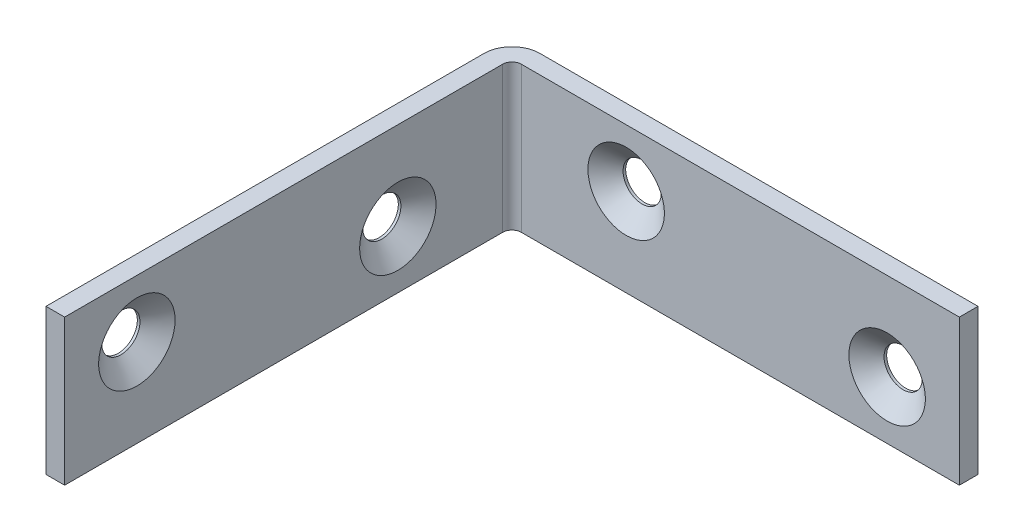
ISO-10303-21;
HEADER;
FILE_DESCRIPTION(('STEP AP214'),'2;1');
FILE_NAME('part.step','',(''),(''),'','','');
FILE_SCHEMA(('AUTOMOTIVE_DESIGN { 1 0 10303 214 1 1 1 1 }'));
ENDSEC;
DATA;
#1=APPLICATION_CONTEXT('core data for automotive mechanical design processes');
#2=APPLICATION_PROTOCOL_DEFINITION('international standard','automotive_design',2000,#1);
#3=PRODUCT_CONTEXT('',#1,'mechanical');
#4=PRODUCT('Part','Part','',(#3));
#5=PRODUCT_RELATED_PRODUCT_CATEGORY('part','',(#4));
#6=PRODUCT_DEFINITION_FORMATION('','',#4);
#7=PRODUCT_DEFINITION_CONTEXT('part definition',#1,'design');
#8=PRODUCT_DEFINITION('design','',#6,#7);
#9=PRODUCT_DEFINITION_SHAPE('','',#8);
#10=(LENGTH_UNIT() NAMED_UNIT(*) SI_UNIT(.MILLI.,.METRE.));
#11=(NAMED_UNIT(*) PLANE_ANGLE_UNIT() SI_UNIT($,.RADIAN.));
#12=(NAMED_UNIT(*) SI_UNIT($,.STERADIAN.) SOLID_ANGLE_UNIT());
#13=UNCERTAINTY_MEASURE_WITH_UNIT(LENGTH_MEASURE(1.E-05),#10,'distance_accuracy_value','');
#14=(GEOMETRIC_REPRESENTATION_CONTEXT(3) GLOBAL_UNCERTAINTY_ASSIGNED_CONTEXT((#13)) GLOBAL_UNIT_ASSIGNED_CONTEXT((#10,
#11,#12)) REPRESENTATION_CONTEXT('',''));
#15=CARTESIAN_POINT('',(0.,0.,0.));
#16=DIRECTION('',(0.,0.,1.));
#17=DIRECTION('',(1.,0.,0.));
#18=AXIS2_PLACEMENT_3D('',#15,#16,#17);
#19=CARTESIAN_POINT('',(3.048,7.9375,2.032));
#20=DIRECTION('',(0.,0.,-1.));
#21=DIRECTION('',(-1.,0.,0.));
#22=AXIS2_PLACEMENT_3D('',#19,#20,#21);
#23=PLANE('',#22);
#24=CARTESIAN_POINT('',(14.478,1.651,2.032));
#25=DIRECTION('',(0.,0.,-1.));
#26=DIRECTION('',(-1.,0.,0.));
#27=AXIS2_PLACEMENT_3D('',#24,#25,#26);
#28=CIRCLE('',#27,4.16560000000001);
#29=CARTESIAN_POINT('',(10.3124,1.651,2.032));
#30=VERTEX_POINT('',#29);
#31=EDGE_CURVE('E105',#30,#30,#28,.T.);
#32=ORIENTED_EDGE('',*,*,#31,.T.);
#33=EDGE_LOOP('',(#32));
#34=FACE_BOUND('',#33,.T.);
#35=CARTESIAN_POINT('',(42.926,-1.651,2.032));
#36=DIRECTION('',(0.,0.,-1.));
#37=DIRECTION('',(-1.,0.,0.));
#38=AXIS2_PLACEMENT_3D('',#35,#36,#37);
#39=CIRCLE('',#38,4.16560000000001);
#40=CARTESIAN_POINT('',(38.7604,-1.651,2.032));
#41=VERTEX_POINT('',#40);
#42=EDGE_CURVE('E233',#41,#41,#39,.T.);
#43=ORIENTED_EDGE('',*,*,#42,.T.);
#44=EDGE_LOOP('',(#43));
#45=FACE_BOUND('',#44,.T.);
#46=DIRECTION('',(1.,0.,0.));
#47=VECTOR('',#46,1.);
#48=CARTESIAN_POINT('',(3.048,-7.9375,2.032));
#49=LINE('',#48,#47);
#50=CARTESIAN_POINT('',(3.048,-7.9375,2.032));
#51=VERTEX_POINT('',#50);
#52=CARTESIAN_POINT('',(50.8,-7.9375,2.032));
#53=VERTEX_POINT('',#52);
#54=EDGE_CURVE('E202',#51,#53,#49,.T.);
#55=ORIENTED_EDGE('',*,*,#54,.T.);
#56=DIRECTION('',(0.,-1.,0.));
#57=VECTOR('',#56,1.);
#58=CARTESIAN_POINT('',(50.8,7.9375,2.032));
#59=LINE('',#58,#57);
#60=CARTESIAN_POINT('',(50.8,7.9375,2.032));
#61=VERTEX_POINT('',#60);
#62=EDGE_CURVE('E230',#61,#53,#59,.T.);
#63=ORIENTED_EDGE('',*,*,#62,.F.);
#64=DIRECTION('',(1.,0.,0.));
#65=VECTOR('',#64,1.);
#66=CARTESIAN_POINT('',(3.048,7.9375,2.032));
#67=LINE('',#66,#65);
#68=CARTESIAN_POINT('',(3.048,7.9375,2.032));
#69=VERTEX_POINT('',#68);
#70=EDGE_CURVE('E160',#69,#61,#67,.T.);
#71=ORIENTED_EDGE('',*,*,#70,.F.);
#72=DIRECTION('',(0.,-1.,0.));
#73=VECTOR('',#72,1.);
#74=CARTESIAN_POINT('',(3.048,7.9375,2.032));
#75=LINE('',#74,#73);
#76=EDGE_CURVE('E201',#69,#51,#75,.T.);
#77=ORIENTED_EDGE('',*,*,#76,.T.);
#78=EDGE_LOOP('',(#55,#63,#71,#77));
#79=FACE_BOUND('',#78,.T.);
#80=ADVANCED_FACE('F101',(#34,#45,#79),#23,.F.);
#81=CARTESIAN_POINT('',(50.8,7.9375,0.));
#82=DIRECTION('',(1.,0.,0.));
#83=DIRECTION('',(0.,0.,-1.));
#84=AXIS2_PLACEMENT_3D('',#81,#82,#83);
#85=PLANE('',#84);
#86=DIRECTION('',(0.,0.,1.));
#87=VECTOR('',#86,1.);
#88=CARTESIAN_POINT('',(50.8,-7.9375,0.));
#89=LINE('',#88,#87);
#90=CARTESIAN_POINT('',(50.8,-7.9375,0.));
#91=VERTEX_POINT('',#90);
#92=EDGE_CURVE('E205',#91,#53,#89,.T.);
#93=ORIENTED_EDGE('',*,*,#92,.F.);
#94=DIRECTION('',(0.,-1.,0.));
#95=VECTOR('',#94,1.);
#96=CARTESIAN_POINT('',(50.8,7.9375,0.));
#97=LINE('',#96,#95);
#98=CARTESIAN_POINT('',(50.8,7.9375,0.));
#99=VERTEX_POINT('',#98);
#100=EDGE_CURVE('E228',#99,#91,#97,.T.);
#101=ORIENTED_EDGE('',*,*,#100,.F.);
#102=DIRECTION('',(0.,0.,1.));
#103=VECTOR('',#102,1.);
#104=CARTESIAN_POINT('',(50.8,7.9375,0.));
#105=LINE('',#104,#103);
#106=EDGE_CURVE('E455',#99,#61,#105,.T.);
#107=ORIENTED_EDGE('',*,*,#106,.T.);
#108=ORIENTED_EDGE('',*,*,#62,.T.);
#109=EDGE_LOOP('',(#93,#101,#107,#108));
#110=FACE_BOUND('',#109,.T.);
#111=ADVANCED_FACE('F280',(#110),#85,.T.);
#112=CARTESIAN_POINT('',(3.048,7.9375,0.));
#113=DIRECTION('',(0.,0.,-1.));
#114=DIRECTION('',(-1.,0.,0.));
#115=AXIS2_PLACEMENT_3D('',#112,#113,#114);
#116=PLANE('',#115);
#117=CARTESIAN_POINT('',(14.478,1.651,0.));
#118=DIRECTION('',(0.,0.,1.));
#119=DIRECTION('',(1.,0.,0.));
#120=AXIS2_PLACEMENT_3D('',#117,#118,#119);
#121=CIRCLE('',#120,2.0828);
#122=CARTESIAN_POINT('',(16.5608,1.651,0.));
#123=VERTEX_POINT('',#122);
#124=EDGE_CURVE('E239',#123,#123,#121,.T.);
#125=ORIENTED_EDGE('',*,*,#124,.T.);
#126=EDGE_LOOP('',(#125));
#127=FACE_BOUND('',#126,.T.);
#128=CARTESIAN_POINT('',(42.926,-1.651,0.));
#129=DIRECTION('',(0.,0.,1.));
#130=DIRECTION('',(1.,0.,0.));
#131=AXIS2_PLACEMENT_3D('',#128,#129,#130);
#132=CIRCLE('',#131,2.0828);
#133=CARTESIAN_POINT('',(45.0088,-1.651,0.));
#134=VERTEX_POINT('',#133);
#135=EDGE_CURVE('E206',#134,#134,#132,.T.);
#136=ORIENTED_EDGE('',*,*,#135,.T.);
#137=EDGE_LOOP('',(#136));
#138=FACE_BOUND('',#137,.T.);
#139=DIRECTION('',(1.,0.,0.));
#140=VECTOR('',#139,1.);
#141=CARTESIAN_POINT('',(3.048,-7.9375,0.));
#142=LINE('',#141,#140);
#143=CARTESIAN_POINT('',(3.048,-7.9375,0.));
#144=VERTEX_POINT('',#143);
#145=EDGE_CURVE('E209',#144,#91,#142,.T.);
#146=ORIENTED_EDGE('',*,*,#145,.F.);
#147=DIRECTION('',(0.,-1.,0.));
#148=VECTOR('',#147,1.);
#149=CARTESIAN_POINT('',(3.048,7.9375,0.));
#150=LINE('',#149,#148);
#151=CARTESIAN_POINT('',(3.048,7.9375,0.));
#152=VERTEX_POINT('',#151);
#153=EDGE_CURVE('E226',#152,#144,#150,.T.);
#154=ORIENTED_EDGE('',*,*,#153,.F.);
#155=DIRECTION('',(1.,0.,0.));
#156=VECTOR('',#155,1.);
#157=CARTESIAN_POINT('',(3.048,7.9375,0.));
#158=LINE('',#157,#156);
#159=EDGE_CURVE('E454',#152,#99,#158,.T.);
#160=ORIENTED_EDGE('',*,*,#159,.T.);
#161=ORIENTED_EDGE('',*,*,#100,.T.);
#162=EDGE_LOOP('',(#146,#154,#160,#161));
#163=FACE_BOUND('',#162,.T.);
#164=ADVANCED_FACE('F260',(#127,#138,#163),#116,.T.);
#165=CARTESIAN_POINT('',(3.048,7.9375,3.048));
#166=DIRECTION('',(0.,-1.,0.));
#167=DIRECTION('',(0.,0.,-1.));
#168=AXIS2_PLACEMENT_3D('',#165,#166,#167);
#169=CYLINDRICAL_SURFACE('',#168,3.048);
#170=CARTESIAN_POINT('',(3.048,-7.9375,3.048));
#171=DIRECTION('',(0.,-1.,0.));
#172=DIRECTION('',(0.,0.,1.));
#173=AXIS2_PLACEMENT_3D('',#170,#171,#172);
#174=CIRCLE('',#173,3.048);
#175=CARTESIAN_POINT('',(0.,-7.9375,3.048));
#176=VERTEX_POINT('',#175);
#177=EDGE_CURVE('E212',#176,#144,#174,.T.);
#178=ORIENTED_EDGE('',*,*,#177,.F.);
#179=DIRECTION('',(0.,-1.,0.));
#180=VECTOR('',#179,1.);
#181=CARTESIAN_POINT('',(0.,7.9375,3.048));
#182=LINE('',#181,#180);
#183=CARTESIAN_POINT('',(0.,7.9375,3.048));
#184=VERTEX_POINT('',#183);
#185=EDGE_CURVE('E224',#184,#176,#182,.T.);
#186=ORIENTED_EDGE('',*,*,#185,.F.);
#187=CARTESIAN_POINT('',(3.048,7.9375,3.048));
#188=DIRECTION('',(0.,-1.,0.));
#189=DIRECTION('',(0.,0.,1.));
#190=AXIS2_PLACEMENT_3D('',#187,#188,#189);
#191=CIRCLE('',#190,3.048);
#192=EDGE_CURVE('E196',#184,#152,#191,.T.);
#193=ORIENTED_EDGE('',*,*,#192,.T.);
#194=ORIENTED_EDGE('',*,*,#153,.T.);
#195=EDGE_LOOP('',(#178,#186,#193,#194));
#196=FACE_BOUND('',#195,.T.);
#197=ADVANCED_FACE('F316',(#196),#169,.T.);
#198=CARTESIAN_POINT('',(0.,7.9375,50.8));
#199=DIRECTION('',(-1.,0.,0.));
#200=DIRECTION('',(0.,0.,1.));
#201=AXIS2_PLACEMENT_3D('',#198,#199,#200);
#202=PLANE('',#201);
#203=CARTESIAN_POINT('',(0.,-1.651,14.478));
#204=DIRECTION('',(1.,0.,0.));
#205=DIRECTION('',(0.,0.,1.));
#206=AXIS2_PLACEMENT_3D('',#203,#204,#205);
#207=CIRCLE('',#206,2.0828);
#208=CARTESIAN_POINT('',(0.,-1.651,16.5608));
#209=VERTEX_POINT('',#208);
#210=EDGE_CURVE('E246',#209,#209,#207,.T.);
#211=ORIENTED_EDGE('',*,*,#210,.T.);
#212=EDGE_LOOP('',(#211));
#213=FACE_BOUND('',#212,.T.);
#214=CARTESIAN_POINT('',(-1.53956708492942E-13,1.651,42.926));
#215=DIRECTION('',(1.,0.,0.));
#216=DIRECTION('',(0.,0.,1.));
#217=AXIS2_PLACEMENT_3D('',#214,#215,#216);
#218=CIRCLE('',#217,2.0828);
#219=CARTESIAN_POINT('',(-1.60200114285303E-13,1.651,45.0088));
#220=VERTEX_POINT('',#219);
#221=EDGE_CURVE('E249',#220,#220,#218,.T.);
#222=ORIENTED_EDGE('',*,*,#221,.T.);
#223=EDGE_LOOP('',(#222));
#224=FACE_BOUND('',#223,.T.);
#225=DIRECTION('',(0.,0.,-1.));
#226=VECTOR('',#225,1.);
#227=CARTESIAN_POINT('',(0.,-7.9375,50.8));
#228=LINE('',#227,#226);
#229=CARTESIAN_POINT('',(0.,-7.9375,50.8));
#230=VERTEX_POINT('',#229);
#231=EDGE_CURVE('E215',#230,#176,#228,.T.);
#232=ORIENTED_EDGE('',*,*,#231,.F.);
#233=DIRECTION('',(0.,-1.,0.));
#234=VECTOR('',#233,1.);
#235=CARTESIAN_POINT('',(0.,7.9375,50.8));
#236=LINE('',#235,#234);
#237=CARTESIAN_POINT('',(0.,7.9375,50.8));
#238=VERTEX_POINT('',#237);
#239=EDGE_CURVE('E184',#238,#230,#236,.T.);
#240=ORIENTED_EDGE('',*,*,#239,.F.);
#241=DIRECTION('',(0.,0.,-1.));
#242=VECTOR('',#241,1.);
#243=CARTESIAN_POINT('',(0.,7.9375,50.8));
#244=LINE('',#243,#242);
#245=EDGE_CURVE('E194',#238,#184,#244,.T.);
#246=ORIENTED_EDGE('',*,*,#245,.T.);
#247=ORIENTED_EDGE('',*,*,#185,.T.);
#248=EDGE_LOOP('',(#232,#240,#246,#247));
#249=FACE_BOUND('',#248,.T.);
#250=ADVANCED_FACE('F313',(#213,#224,#249),#202,.T.);
#251=CARTESIAN_POINT('',(2.032,7.9375,50.8));
#252=DIRECTION('',(0.,0.,1.));
#253=DIRECTION('',(1.,0.,0.));
#254=AXIS2_PLACEMENT_3D('',#251,#252,#253);
#255=PLANE('',#254);
#256=DIRECTION('',(-1.,0.,0.));
#257=VECTOR('',#256,1.);
#258=CARTESIAN_POINT('',(2.032,-7.9375,50.8));
#259=LINE('',#258,#257);
#260=CARTESIAN_POINT('',(2.032,-7.9375,50.8));
#261=VERTEX_POINT('',#260);
#262=EDGE_CURVE('E183',#261,#230,#259,.T.);
#263=ORIENTED_EDGE('',*,*,#262,.F.);
#264=DIRECTION('',(0.,-1.,0.));
#265=VECTOR('',#264,1.);
#266=CARTESIAN_POINT('',(2.032,7.9375,50.8));
#267=LINE('',#266,#265);
#268=CARTESIAN_POINT('',(2.032,7.9375,50.8));
#269=VERTEX_POINT('',#268);
#270=EDGE_CURVE('E177',#269,#261,#267,.T.);
#271=ORIENTED_EDGE('',*,*,#270,.F.);
#272=DIRECTION('',(-1.,0.,0.));
#273=VECTOR('',#272,1.);
#274=CARTESIAN_POINT('',(2.032,7.9375,50.8));
#275=LINE('',#274,#273);
#276=EDGE_CURVE('E181',#269,#238,#275,.T.);
#277=ORIENTED_EDGE('',*,*,#276,.T.);
#278=ORIENTED_EDGE('',*,*,#239,.T.);
#279=EDGE_LOOP('',(#263,#271,#277,#278));
#280=FACE_BOUND('',#279,.T.);
#281=ADVANCED_FACE('F179',(#280),#255,.T.);
#282=CARTESIAN_POINT('',(2.032,7.9375,50.8));
#283=DIRECTION('',(-1.,0.,0.));
#284=DIRECTION('',(0.,0.,1.));
#285=AXIS2_PLACEMENT_3D('',#282,#283,#284);
#286=PLANE('',#285);
#287=CARTESIAN_POINT('',(2.032,-1.651,14.478));
#288=DIRECTION('',(-1.,0.,0.));
#289=DIRECTION('',(0.,0.,1.));
#290=AXIS2_PLACEMENT_3D('',#287,#288,#289);
#291=CIRCLE('',#290,4.16560000000008);
#292=CARTESIAN_POINT('',(2.032,-1.651,18.6436000000001));
#293=VERTEX_POINT('',#292);
#294=EDGE_CURVE('E243',#293,#293,#291,.T.);
#295=ORIENTED_EDGE('',*,*,#294,.T.);
#296=EDGE_LOOP('',(#295));
#297=FACE_BOUND('',#296,.T.);
#298=CARTESIAN_POINT('',(2.032,1.651,42.926));
#299=DIRECTION('',(-1.,0.,0.));
#300=DIRECTION('',(0.,0.,1.));
#301=AXIS2_PLACEMENT_3D('',#298,#299,#300);
#302=CIRCLE('',#301,4.16560000000019);
#303=CARTESIAN_POINT('',(2.032,1.651,38.7603999999999));
#304=VERTEX_POINT('',#303);
#305=EDGE_CURVE('E242',#304,#304,#302,.T.);
#306=ORIENTED_EDGE('',*,*,#305,.T.);
#307=EDGE_LOOP('',(#306));
#308=FACE_BOUND('',#307,.T.);
#309=DIRECTION('',(0.,0.,-1.));
#310=VECTOR('',#309,1.);
#311=CARTESIAN_POINT('',(2.032,-7.9375,50.8));
#312=LINE('',#311,#310);
#313=CARTESIAN_POINT('',(2.032,-7.9375,3.048));
#314=VERTEX_POINT('',#313);
#315=EDGE_CURVE('E148',#261,#314,#312,.T.);
#316=ORIENTED_EDGE('',*,*,#315,.T.);
#317=DIRECTION('',(0.,-1.,0.));
#318=VECTOR('',#317,1.);
#319=CARTESIAN_POINT('',(2.032,7.9375,3.048));
#320=LINE('',#319,#318);
#321=CARTESIAN_POINT('',(2.032,7.9375,3.048));
#322=VERTEX_POINT('',#321);
#323=EDGE_CURVE('E185',#322,#314,#320,.T.);
#324=ORIENTED_EDGE('',*,*,#323,.F.);
#325=DIRECTION('',(0.,0.,-1.));
#326=VECTOR('',#325,1.);
#327=CARTESIAN_POINT('',(2.032,7.9375,50.8));
#328=LINE('',#327,#326);
#329=EDGE_CURVE('E187',#269,#322,#328,.T.);
#330=ORIENTED_EDGE('',*,*,#329,.F.);
#331=ORIENTED_EDGE('',*,*,#270,.T.);
#332=EDGE_LOOP('',(#316,#324,#330,#331));
#333=FACE_BOUND('',#332,.T.);
#334=ADVANCED_FACE('F188',(#297,#308,#333),#286,.F.);
#335=CARTESIAN_POINT('',(3.048,7.9375,3.048));
#336=DIRECTION('',(0.,-1.,0.));
#337=DIRECTION('',(0.,0.,-1.));
#338=AXIS2_PLACEMENT_3D('',#335,#336,#337);
#339=CYLINDRICAL_SURFACE('',#338,1.016);
#340=CARTESIAN_POINT('',(3.048,-7.9375,3.048));
#341=DIRECTION('',(0.,1.,0.));
#342=DIRECTION('',(1.,0.,0.));
#343=AXIS2_PLACEMENT_3D('',#340,#341,#342);
#344=CIRCLE('',#343,1.016);
#345=EDGE_CURVE('E154',#314,#51,#344,.F.);
#346=ORIENTED_EDGE('',*,*,#345,.T.);
#347=ORIENTED_EDGE('',*,*,#76,.F.);
#348=CARTESIAN_POINT('',(3.048,7.9375,3.048));
#349=DIRECTION('',(0.,1.,0.));
#350=DIRECTION('',(1.,0.,0.));
#351=AXIS2_PLACEMENT_3D('',#348,#349,#350);
#352=CIRCLE('',#351,1.016);
#353=EDGE_CURVE('E120',#322,#69,#352,.F.);
#354=ORIENTED_EDGE('',*,*,#353,.F.);
#355=ORIENTED_EDGE('',*,*,#323,.T.);
#356=EDGE_LOOP('',(#346,#347,#354,#355));
#357=FACE_BOUND('',#356,.T.);
#358=ADVANCED_FACE('F326',(#357),#339,.F.);
#359=CARTESIAN_POINT('',(3.048,7.9375,3.048));
#360=DIRECTION('',(0.,-1.,0.));
#361=DIRECTION('',(-1.,0.,0.));
#362=AXIS2_PLACEMENT_3D('',#359,#360,#361);
#363=PLANE('',#362);
#364=ORIENTED_EDGE('',*,*,#70,.T.);
#365=ORIENTED_EDGE('',*,*,#106,.F.);
#366=ORIENTED_EDGE('',*,*,#159,.F.);
#367=ORIENTED_EDGE('',*,*,#192,.F.);
#368=ORIENTED_EDGE('',*,*,#245,.F.);
#369=ORIENTED_EDGE('',*,*,#276,.F.);
#370=ORIENTED_EDGE('',*,*,#329,.T.);
#371=ORIENTED_EDGE('',*,*,#353,.T.);
#372=EDGE_LOOP('',(#364,#365,#366,#367,#368,#369,#370,#371));
#373=FACE_BOUND('',#372,.T.);
#374=ADVANCED_FACE('F191',(#373),#363,.F.);
#375=CARTESIAN_POINT('',(3.048,-7.9375,3.048));
#376=DIRECTION('',(0.,-1.,0.));
#377=DIRECTION('',(-1.,0.,0.));
#378=AXIS2_PLACEMENT_3D('',#375,#376,#377);
#379=PLANE('',#378);
#380=ORIENTED_EDGE('',*,*,#54,.F.);
#381=ORIENTED_EDGE('',*,*,#345,.F.);
#382=ORIENTED_EDGE('',*,*,#315,.F.);
#383=ORIENTED_EDGE('',*,*,#262,.T.);
#384=ORIENTED_EDGE('',*,*,#231,.T.);
#385=ORIENTED_EDGE('',*,*,#177,.T.);
#386=ORIENTED_EDGE('',*,*,#145,.T.);
#387=ORIENTED_EDGE('',*,*,#92,.T.);
#388=EDGE_LOOP('',(#380,#381,#382,#383,#384,#385,#386,#387));
#389=FACE_BOUND('',#388,.T.);
#390=ADVANCED_FACE('F275',(#389),#379,.T.);
#391=CARTESIAN_POINT('',(42.926,-1.651,0.));
#392=DIRECTION('',(0.,0.,1.));
#393=DIRECTION('',(1.,0.,0.));
#394=AXIS2_PLACEMENT_3D('',#391,#392,#393);
#395=CYLINDRICAL_SURFACE('',#394,2.0828);
#396=CARTESIAN_POINT('',(42.926,-1.651,0.284323288183958));
#397=DIRECTION('',(0.,0.,-1.));
#398=DIRECTION('',(-1.,0.,0.));
#399=AXIS2_PLACEMENT_3D('',#396,#397,#398);
#400=CIRCLE('',#399,2.0828);
#401=CARTESIAN_POINT('',(40.8432,-1.651,0.284323288183958));
#402=VERTEX_POINT('',#401);
#403=EDGE_CURVE('E13',#402,#402,#400,.F.);
#404=ORIENTED_EDGE('',*,*,#403,.T.);
#405=EDGE_LOOP('',(#404));
#406=FACE_BOUND('',#405,.T.);
#407=ORIENTED_EDGE('',*,*,#135,.F.);
#408=EDGE_LOOP('',(#407));
#409=FACE_BOUND('',#408,.T.);
#410=ADVANCED_FACE('F266',(#406,#409),#395,.F.);
#411=CARTESIAN_POINT('',(14.478,1.651,0.));
#412=DIRECTION('',(0.,0.,1.));
#413=DIRECTION('',(1.,0.,0.));
#414=AXIS2_PLACEMENT_3D('',#411,#412,#413);
#415=CYLINDRICAL_SURFACE('',#414,2.0828);
#416=CARTESIAN_POINT('',(14.478,1.651,0.284323288183958));
#417=DIRECTION('',(0.,0.,-1.));
#418=DIRECTION('',(-1.,0.,0.));
#419=AXIS2_PLACEMENT_3D('',#416,#417,#418);
#420=CIRCLE('',#419,2.0828);
#421=CARTESIAN_POINT('',(12.3952,1.651,0.284323288183958));
#422=VERTEX_POINT('',#421);
#423=EDGE_CURVE('E111',#422,#422,#420,.F.);
#424=ORIENTED_EDGE('',*,*,#423,.T.);
#425=EDGE_LOOP('',(#424));
#426=FACE_BOUND('',#425,.T.);
#427=ORIENTED_EDGE('',*,*,#124,.F.);
#428=EDGE_LOOP('',(#427));
#429=FACE_BOUND('',#428,.T.);
#430=ADVANCED_FACE('F263',(#426,#429),#415,.F.);
#431=CARTESIAN_POINT('',(-1.53956708492942E-13,1.651,42.926));
#432=DIRECTION('',(1.,0.,0.));
#433=DIRECTION('',(0.,0.,-1.));
#434=AXIS2_PLACEMENT_3D('',#431,#432,#433);
#435=CYLINDRICAL_SURFACE('',#434,2.0828);
#436=CARTESIAN_POINT('',(0.284323288183828,1.651,42.926));
#437=DIRECTION('',(-1.,0.,0.));
#438=DIRECTION('',(0.,0.,1.));
#439=AXIS2_PLACEMENT_3D('',#436,#437,#438);
#440=CIRCLE('',#439,2.0828);
#441=CARTESIAN_POINT('',(0.284323288183837,1.651,40.8432));
#442=VERTEX_POINT('',#441);
#443=EDGE_CURVE('E231',#442,#442,#440,.F.);
#444=ORIENTED_EDGE('',*,*,#443,.T.);
#445=EDGE_LOOP('',(#444));
#446=FACE_BOUND('',#445,.T.);
#447=ORIENTED_EDGE('',*,*,#221,.F.);
#448=EDGE_LOOP('',(#447));
#449=FACE_BOUND('',#448,.T.);
#450=ADVANCED_FACE('F265',(#446,#449),#435,.F.);
#451=CARTESIAN_POINT('',(0.,-1.651,14.478));
#452=DIRECTION('',(1.,0.,0.));
#453=DIRECTION('',(0.,0.,-1.));
#454=AXIS2_PLACEMENT_3D('',#451,#452,#453);
#455=CYLINDRICAL_SURFACE('',#454,2.0828);
#456=CARTESIAN_POINT('',(0.284323288183931,-1.651,14.478));
#457=DIRECTION('',(-1.,0.,0.));
#458=DIRECTION('',(0.,0.,1.));
#459=AXIS2_PLACEMENT_3D('',#456,#457,#458);
#460=CIRCLE('',#459,2.0828);
#461=CARTESIAN_POINT('',(0.284323288183924,-1.651,16.5608));
#462=VERTEX_POINT('',#461);
#463=EDGE_CURVE('E236',#462,#462,#460,.F.);
#464=ORIENTED_EDGE('',*,*,#463,.T.);
#465=EDGE_LOOP('',(#464));
#466=FACE_BOUND('',#465,.T.);
#467=ORIENTED_EDGE('',*,*,#210,.F.);
#468=EDGE_LOOP('',(#467));
#469=FACE_BOUND('',#468,.T.);
#470=ADVANCED_FACE('F272',(#466,#469),#455,.F.);
#471=CARTESIAN_POINT('',(0.284323288183828,1.651,42.926));
#472=DIRECTION('',(1.,0.,0.));
#473=DIRECTION('',(0.,0.,-1.));
#474=AXIS2_PLACEMENT_3D('',#471,#472,#473);
#475=CONICAL_SURFACE('',#474,2.0828,0.872664625997166);
#476=CARTESIAN_POINT('',(2.032,1.651,38.7603999999999));
#477=CARTESIAN_POINT('',(2.01379503425191,1.651,38.7820958333332));
#478=CARTESIAN_POINT('',(1.99559006850383,1.651,38.8037916666665));
#479=CARTESIAN_POINT('',(1.95918013700766,1.651,38.8471833333332));
#480=CARTESIAN_POINT('',(1.94097517125957,1.651,38.8688791666665));
#481=CARTESIAN_POINT('',(1.9045652397634,1.651,38.9122708333332));
#482=CARTESIAN_POINT('',(1.88636027401532,1.651,38.9339666666665));
#483=CARTESIAN_POINT('',(1.84995034251915,1.651,38.9773583333332));
#484=CARTESIAN_POINT('',(1.83174537677107,1.651,38.9990541666665));
#485=CARTESIAN_POINT('',(1.7953354452749,1.651,39.0424458333332));
#486=CARTESIAN_POINT('',(1.77713047952681,1.651,39.0641416666665));
#487=CARTESIAN_POINT('',(1.74072054803064,1.651,39.1075333333332));
#488=CARTESIAN_POINT('',(1.72251558228255,1.651,39.1292291666665));
#489=CARTESIAN_POINT('',(1.68610565078638,1.651,39.1726208333332));
#490=CARTESIAN_POINT('',(1.6679006850383,1.651,39.1943166666665));
#491=CARTESIAN_POINT('',(1.63149075354213,1.651,39.2377083333332));
#492=CARTESIAN_POINT('',(1.61328578779404,1.651,39.2594041666666));
#493=CARTESIAN_POINT('',(1.57687585629787,1.651,39.3027958333332));
#494=CARTESIAN_POINT('',(1.55867089054979,1.651,39.3244916666666));
#495=CARTESIAN_POINT('',(1.52226095905362,1.651,39.3678833333332));
#496=CARTESIAN_POINT('',(1.50405599330553,1.651,39.3895791666666));
#497=CARTESIAN_POINT('',(1.46764606180936,1.651,39.4329708333332));
#498=CARTESIAN_POINT('',(1.44944109606128,1.651,39.4546666666666));
#499=CARTESIAN_POINT('',(1.41303116456511,1.651,39.4980583333332));
#500=CARTESIAN_POINT('',(1.39482619881702,1.651,39.5197541666666));
#501=CARTESIAN_POINT('',(1.35841626732085,1.651,39.5631458333332));
#502=CARTESIAN_POINT('',(1.34021130157277,1.651,39.5848416666666));
#503=CARTESIAN_POINT('',(1.3038013700766,1.651,39.6282333333332));
#504=CARTESIAN_POINT('',(1.28559640432851,1.651,39.6499291666666));
#505=CARTESIAN_POINT('',(1.24918647283234,1.651,39.6933208333333));
#506=CARTESIAN_POINT('',(1.23098150708426,1.651,39.7150166666666));
#507=CARTESIAN_POINT('',(1.19457157558809,1.651,39.7584083333333));
#508=CARTESIAN_POINT('',(1.17636660984,1.651,39.7801041666666));
#509=CARTESIAN_POINT('',(1.13995667834383,1.651,39.8234958333333));
#510=CARTESIAN_POINT('',(1.12175171259575,1.651,39.8451916666666));
#511=CARTESIAN_POINT('',(1.08534178109958,1.651,39.8885833333333));
#512=CARTESIAN_POINT('',(1.06713681535149,1.651,39.9102791666666));
#513=CARTESIAN_POINT('',(1.03072688385532,1.651,39.9536708333333));
#514=CARTESIAN_POINT('',(1.01252191810724,1.651,39.9753666666666));
#515=CARTESIAN_POINT('',(0.976111986611068,1.651,40.0187583333333));
#516=CARTESIAN_POINT('',(0.957907020862983,1.651,40.0404541666666));
#517=CARTESIAN_POINT('',(0.921497089366813,1.651,40.0838458333333));
#518=CARTESIAN_POINT('',(0.903292123618728,1.651,40.1055416666666));
#519=CARTESIAN_POINT('',(0.866882192122558,1.651,40.1489333333333));
#520=CARTESIAN_POINT('',(0.848677226374473,1.651,40.1706291666666));
#521=CARTESIAN_POINT('',(0.812267294878303,1.651,40.2140208333333));
#522=CARTESIAN_POINT('',(0.794062329130217,1.651,40.2357166666666));
#523=CARTESIAN_POINT('',(0.757652397634047,1.651,40.2791083333333));
#524=CARTESIAN_POINT('',(0.739447431885963,1.651,40.3008041666666));
#525=CARTESIAN_POINT('',(0.703037500389792,1.651,40.3441958333333));
#526=CARTESIAN_POINT('',(0.684832534641707,1.651,40.3658916666666));
#527=CARTESIAN_POINT('',(0.648422603145537,1.651,40.4092833333333));
#528=CARTESIAN_POINT('',(0.630217637397452,1.651,40.4309791666666));
#529=CARTESIAN_POINT('',(0.593807705901282,1.651,40.4743708333333));
#530=CARTESIAN_POINT('',(0.575602740153197,1.651,40.4960666666666));
#531=CARTESIAN_POINT('',(0.539192808657027,1.651,40.5394583333333));
#532=CARTESIAN_POINT('',(0.520987842908942,1.651,40.5611541666666));
#533=CARTESIAN_POINT('',(0.484577911412772,1.651,40.6045458333333));
#534=CARTESIAN_POINT('',(0.466372945664687,1.651,40.6262416666666));
#535=CARTESIAN_POINT('',(0.429963014168517,1.651,40.6696333333333));
#536=CARTESIAN_POINT('',(0.411758048420432,1.651,40.6913291666666));
#537=CARTESIAN_POINT('',(0.375348116924262,1.651,40.7347208333333));
#538=CARTESIAN_POINT('',(0.357143151176177,1.651,40.7564166666667));
#539=CARTESIAN_POINT('',(0.320733219680006,1.651,40.7998083333333));
#540=CARTESIAN_POINT('',(0.30252825393192,1.651,40.8215041666667));
#541=CARTESIAN_POINT('',(0.284323288183837,1.651,40.8432));
#542=B_SPLINE_CURVE_WITH_KNOTS('',3,(#476,#477,#478,#479,#480,#481,#482,#483,#484,#485,#486,
#487,#488,#489,#490,#491,#492,#493,#494,#495,#496,#497,#498,#499,#500,#501,#502,#503,#504,#505,
#506,#507,#508,#509,#510,#511,#512,#513,#514,#515,#516,#517,#518,#519,#520,#521,#522,#523,#524,
#525,#526,#527,#528,#529,#530,#531,#532,#533,#534,#535,#536,#537,#538,#539,#540,#541),
.UNSPECIFIED.,.F.,.F.,(4,2,2,2,2,2,2,2,2,2,2,2,2,2,2,2,2,2,2,2,2,2,2,2,2,2,2,2,2,2,2,2,4),(0.,
0.0849656969444211,0.169931393888842,0.254897090833263,0.339862787777684,0.4248284847221,
0.509794181666521,0.594759878610942,0.679725575555363,0.764691272499784,0.849656969444206,
0.934622666388627,1.01958836333305,1.10455406027747,1.18951975722189,1.27448545416631,
1.35945115111073,1.44441684805514,1.52938254499956,1.61434824194398,1.69931393888841,
1.78427963583283,1.86924533277725,1.95421102972167,2.03917672666609,2.12414242361051,
2.20910812055493,2.29407381749935,2.37903951444377,2.4640052113882,2.54897090833262,
2.63393660527703,2.71890230222145),.UNSPECIFIED.);
#543=EDGE_CURVE('BSEAM299',#304,#442,#542,.T.);
#544=ORIENTED_EDGE('',*,*,#305,.F.);
#545=ORIENTED_EDGE('',*,*,#443,.F.);
#546=ORIENTED_EDGE('',*,*,#543,.T.);
#547=ORIENTED_EDGE('',*,*,#543,.F.);
#548=EDGE_LOOP('',(#544,#546,#545,#547));
#549=FACE_BOUND('',#548,.T.);
#550=ADVANCED_FACE('F299',(#549),#475,.F.);
#551=CARTESIAN_POINT('',(0.284323288183932,-1.651,14.478));
#552=DIRECTION('',(1.,0.,0.));
#553=DIRECTION('',(0.,0.,-1.));
#554=AXIS2_PLACEMENT_3D('',#551,#552,#553);
#555=CONICAL_SURFACE('',#554,2.0828,0.872664625997171);
#556=ORIENTED_EDGE('',*,*,#294,.F.);
#557=EDGE_LOOP('',(#556));
#558=FACE_BOUND('',#557,.T.);
#559=ORIENTED_EDGE('',*,*,#463,.F.);
#560=EDGE_LOOP('',(#559));
#561=FACE_BOUND('',#560,.T.);
#562=ADVANCED_FACE('F296',(#558,#561),#555,.F.);
#563=CARTESIAN_POINT('',(14.478,1.651,0.284323288183958));
#564=DIRECTION('',(0.,0.,1.));
#565=DIRECTION('',(1.,0.,0.));
#566=AXIS2_PLACEMENT_3D('',#563,#564,#565);
#567=CONICAL_SURFACE('',#566,2.0828,0.872664625997165);
#568=ORIENTED_EDGE('',*,*,#423,.F.);
#569=EDGE_LOOP('',(#568));
#570=FACE_BOUND('',#569,.T.);
#571=ORIENTED_EDGE('',*,*,#31,.F.);
#572=EDGE_LOOP('',(#571));
#573=FACE_BOUND('',#572,.T.);
#574=ADVANCED_FACE('F103',(#570,#573),#567,.F.);
#575=CARTESIAN_POINT('',(42.926,-1.651,0.284323288183958));
#576=DIRECTION('',(0.,0.,1.));
#577=DIRECTION('',(1.,0.,0.));
#578=AXIS2_PLACEMENT_3D('',#575,#576,#577);
#579=CONICAL_SURFACE('',#578,2.0828,0.872664625997165);
#580=ORIENTED_EDGE('',*,*,#42,.F.);
#581=EDGE_LOOP('',(#580));
#582=FACE_BOUND('',#581,.T.);
#583=ORIENTED_EDGE('',*,*,#403,.F.);
#584=EDGE_LOOP('',(#583));
#585=FACE_BOUND('',#584,.T.);
#586=ADVANCED_FACE('F292',(#582,#585),#579,.F.);
#587=CLOSED_SHELL('',(#80,#111,#164,#197,#250,#281,#334,#358,#374,#390,#410,#430,#450,#470,#550,
#562,#574,#586));
#588=MANIFOLD_SOLID_BREP('B2',#587);
#589=ADVANCED_BREP_SHAPE_REPRESENTATION('',(#18,#588),#14);
#590=SHAPE_DEFINITION_REPRESENTATION(#9,#589);
ENDSEC;
END-ISO-10303-21;
